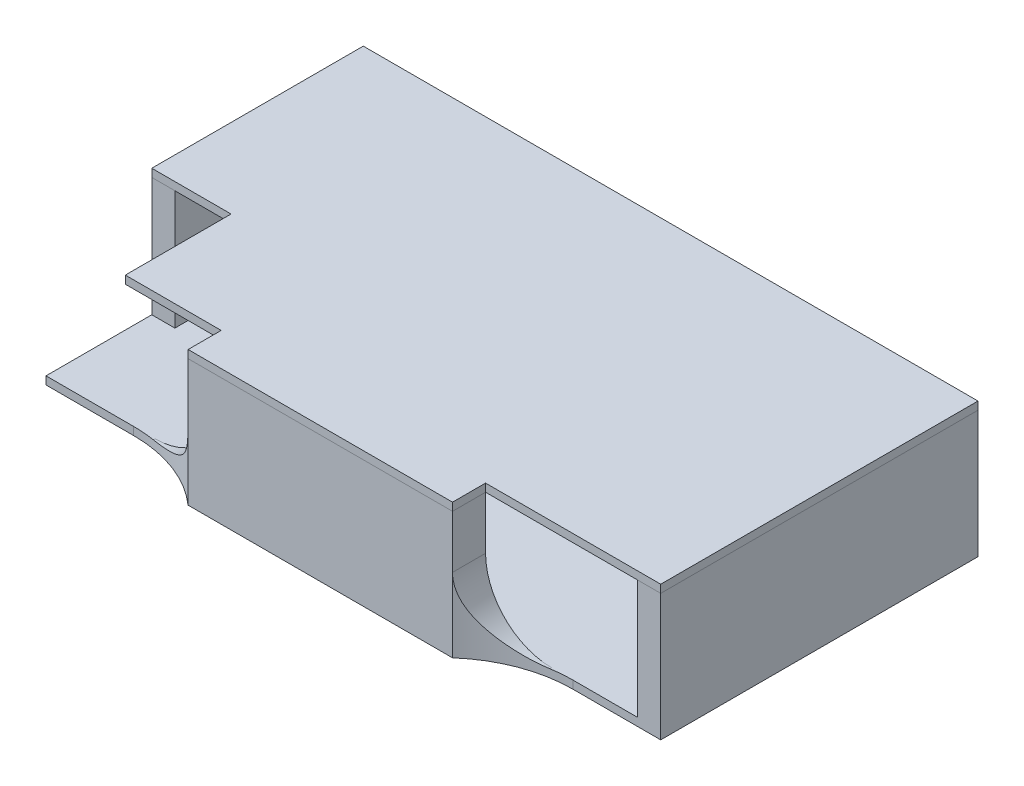
ISO-10303-21;
HEADER;
FILE_DESCRIPTION(('STEP AP214'),'2;1');
FILE_NAME('part.step','',(''),(''),'','','');
FILE_SCHEMA(('AUTOMOTIVE_DESIGN { 1 0 10303 214 1 1 1 1 }'));
ENDSEC;
DATA;
#1=APPLICATION_CONTEXT('core data for automotive mechanical design processes');
#2=APPLICATION_PROTOCOL_DEFINITION('international standard','automotive_design',2000,#1);
#3=PRODUCT_CONTEXT('',#1,'mechanical');
#4=PRODUCT('Part','Part','',(#3));
#5=PRODUCT_RELATED_PRODUCT_CATEGORY('part','',(#4));
#6=PRODUCT_DEFINITION_FORMATION('','',#4);
#7=PRODUCT_DEFINITION_CONTEXT('part definition',#1,'design');
#8=PRODUCT_DEFINITION('design','',#6,#7);
#9=PRODUCT_DEFINITION_SHAPE('','',#8);
#10=(LENGTH_UNIT() NAMED_UNIT(*) SI_UNIT(.MILLI.,.METRE.));
#11=(NAMED_UNIT(*) PLANE_ANGLE_UNIT() SI_UNIT($,.RADIAN.));
#12=(NAMED_UNIT(*) SI_UNIT($,.STERADIAN.) SOLID_ANGLE_UNIT());
#13=UNCERTAINTY_MEASURE_WITH_UNIT(LENGTH_MEASURE(1.E-05),#10,'distance_accuracy_value','');
#14=(GEOMETRIC_REPRESENTATION_CONTEXT(3) GLOBAL_UNCERTAINTY_ASSIGNED_CONTEXT((#13)) GLOBAL_UNIT_ASSIGNED_CONTEXT((#10,
#11,#12)) REPRESENTATION_CONTEXT('',''));
#15=CARTESIAN_POINT('',(0.,0.,0.));
#16=DIRECTION('',(0.,0.,1.));
#17=DIRECTION('',(1.,0.,0.));
#18=AXIS2_PLACEMENT_3D('',#15,#16,#17);
#19=CARTESIAN_POINT('',(-23.25,10.2,-12.));
#20=DIRECTION('',(1.,0.,0.));
#21=DIRECTION('',(0.,0.,-1.));
#22=AXIS2_PLACEMENT_3D('',#19,#20,#21);
#23=PLANE('',#22);
#24=DIRECTION('',(0.,0.,1.));
#25=VECTOR('',#24,1.);
#26=CARTESIAN_POINT('',(-23.25,9.6,-12.));
#27=LINE('',#26,#25);
#28=CARTESIAN_POINT('',(-23.25,9.6,-12.));
#29=VERTEX_POINT('',#28);
#30=CARTESIAN_POINT('',(-23.25,9.6,4.));
#31=VERTEX_POINT('',#30);
#32=EDGE_CURVE('E153',#29,#31,#27,.T.);
#33=ORIENTED_EDGE('',*,*,#32,.T.);
#34=DIRECTION('',(0.,-1.,0.));
#35=VECTOR('',#34,1.);
#36=CARTESIAN_POINT('',(-23.25,10.2,4.));
#37=LINE('',#36,#35);
#38=CARTESIAN_POINT('',(-23.25,10.2,4.));
#39=VERTEX_POINT('',#38);
#40=EDGE_CURVE('E12',#39,#31,#37,.T.);
#41=ORIENTED_EDGE('',*,*,#40,.F.);
#42=DIRECTION('',(0.,0.,1.));
#43=VECTOR('',#42,1.);
#44=CARTESIAN_POINT('',(-23.25,10.2,-12.));
#45=LINE('',#44,#43);
#46=CARTESIAN_POINT('',(-23.25,10.2,-12.));
#47=VERTEX_POINT('',#46);
#48=EDGE_CURVE('E171',#47,#39,#45,.T.);
#49=ORIENTED_EDGE('',*,*,#48,.F.);
#50=DIRECTION('',(0.,-1.,0.));
#51=VECTOR('',#50,1.);
#52=CARTESIAN_POINT('',(-23.25,10.2,-12.));
#53=LINE('',#52,#51);
#54=EDGE_CURVE('E149',#47,#29,#53,.T.);
#55=ORIENTED_EDGE('',*,*,#54,.T.);
#56=EDGE_LOOP('',(#33,#41,#49,#55));
#57=FACE_BOUND('',#56,.T.);
#58=ADVANCED_FACE('F45',(#57),#23,.F.);
#59=CARTESIAN_POINT('',(-23.25,10.2,4.));
#60=DIRECTION('',(0.,0.,-1.));
#61=DIRECTION('',(-1.,0.,0.));
#62=AXIS2_PLACEMENT_3D('',#59,#60,#61);
#63=PLANE('',#62);
#64=DIRECTION('',(1.,0.,0.));
#65=VECTOR('',#64,1.);
#66=CARTESIAN_POINT('',(-23.25,9.6,4.));
#67=LINE('',#66,#65);
#68=CARTESIAN_POINT('',(-17.25,9.6,4.));
#69=VERTEX_POINT('',#68);
#70=EDGE_CURVE('E156',#31,#69,#67,.T.);
#71=ORIENTED_EDGE('',*,*,#70,.T.);
#72=DIRECTION('',(0.,-1.,0.));
#73=VECTOR('',#72,1.);
#74=CARTESIAN_POINT('',(-17.25,10.2,4.));
#75=LINE('',#74,#73);
#76=CARTESIAN_POINT('',(-17.25,10.2,4.));
#77=VERTEX_POINT('',#76);
#78=EDGE_CURVE('E53',#77,#69,#75,.T.);
#79=ORIENTED_EDGE('',*,*,#78,.F.);
#80=DIRECTION('',(1.,0.,0.));
#81=VECTOR('',#80,1.);
#82=CARTESIAN_POINT('',(-23.25,10.2,4.));
#83=LINE('',#82,#81);
#84=EDGE_CURVE('E110',#39,#77,#83,.T.);
#85=ORIENTED_EDGE('',*,*,#84,.F.);
#86=ORIENTED_EDGE('',*,*,#40,.T.);
#87=EDGE_LOOP('',(#71,#79,#85,#86));
#88=FACE_BOUND('',#87,.T.);
#89=ADVANCED_FACE('F220',(#88),#63,.F.);
#90=CARTESIAN_POINT('',(-17.25,10.2,4.));
#91=DIRECTION('',(1.,0.,0.));
#92=DIRECTION('',(0.,0.,-1.));
#93=AXIS2_PLACEMENT_3D('',#90,#91,#92);
#94=PLANE('',#93);
#95=DIRECTION('',(0.,0.,1.));
#96=VECTOR('',#95,1.);
#97=CARTESIAN_POINT('',(-17.25,9.6,4.));
#98=LINE('',#97,#96);
#99=CARTESIAN_POINT('',(-17.25,9.6,12.));
#100=VERTEX_POINT('',#99);
#101=EDGE_CURVE('E158',#69,#100,#98,.T.);
#102=ORIENTED_EDGE('',*,*,#101,.T.);
#103=DIRECTION('',(0.,-1.,0.));
#104=VECTOR('',#103,1.);
#105=CARTESIAN_POINT('',(-17.25,10.2,12.));
#106=LINE('',#105,#104);
#107=CARTESIAN_POINT('',(-17.25,10.2,12.));
#108=VERTEX_POINT('',#107);
#109=EDGE_CURVE('E184',#108,#100,#106,.T.);
#110=ORIENTED_EDGE('',*,*,#109,.F.);
#111=DIRECTION('',(0.,0.,1.));
#112=VECTOR('',#111,1.);
#113=CARTESIAN_POINT('',(-17.25,10.2,4.));
#114=LINE('',#113,#112);
#115=EDGE_CURVE('E192',#77,#108,#114,.T.);
#116=ORIENTED_EDGE('',*,*,#115,.F.);
#117=ORIENTED_EDGE('',*,*,#78,.T.);
#118=EDGE_LOOP('',(#102,#110,#116,#117));
#119=FACE_BOUND('',#118,.T.);
#120=ADVANCED_FACE('F190',(#119),#94,.F.);
#121=CARTESIAN_POINT('',(-17.25,10.2,12.));
#122=DIRECTION('',(0.,0.,-1.));
#123=DIRECTION('',(-1.,0.,0.));
#124=AXIS2_PLACEMENT_3D('',#121,#122,#123);
#125=PLANE('',#124);
#126=DIRECTION('',(1.,0.,0.));
#127=VECTOR('',#126,1.);
#128=CARTESIAN_POINT('',(-17.25,9.6,12.));
#129=LINE('',#128,#127);
#130=CARTESIAN_POINT('',(-10.,9.6,12.));
#131=VERTEX_POINT('',#130);
#132=EDGE_CURVE('E160',#100,#131,#129,.T.);
#133=ORIENTED_EDGE('',*,*,#132,.T.);
#134=DIRECTION('',(0.,-1.,0.));
#135=VECTOR('',#134,1.);
#136=CARTESIAN_POINT('',(-10.,10.2,12.));
#137=LINE('',#136,#135);
#138=CARTESIAN_POINT('',(-10.,10.2,12.));
#139=VERTEX_POINT('',#138);
#140=EDGE_CURVE('E181',#139,#131,#137,.T.);
#141=ORIENTED_EDGE('',*,*,#140,.F.);
#142=DIRECTION('',(1.,0.,0.));
#143=VECTOR('',#142,1.);
#144=CARTESIAN_POINT('',(-17.25,10.2,12.));
#145=LINE('',#144,#143);
#146=EDGE_CURVE('E210',#108,#139,#145,.T.);
#147=ORIENTED_EDGE('',*,*,#146,.F.);
#148=ORIENTED_EDGE('',*,*,#109,.T.);
#149=EDGE_LOOP('',(#133,#141,#147,#148));
#150=FACE_BOUND('',#149,.T.);
#151=ADVANCED_FACE('F201',(#150),#125,.F.);
#152=CARTESIAN_POINT('',(-10.,10.2,12.));
#153=DIRECTION('',(1.,0.,0.));
#154=DIRECTION('',(0.,0.,-1.));
#155=AXIS2_PLACEMENT_3D('',#152,#153,#154);
#156=PLANE('',#155);
#157=DIRECTION('',(0.,0.,1.));
#158=VECTOR('',#157,1.);
#159=CARTESIAN_POINT('',(-10.,9.6,12.));
#160=LINE('',#159,#158);
#161=CARTESIAN_POINT('',(-10.,9.6,14.5));
#162=VERTEX_POINT('',#161);
#163=EDGE_CURVE('E162',#131,#162,#160,.T.);
#164=ORIENTED_EDGE('',*,*,#163,.T.);
#165=DIRECTION('',(0.,-1.,0.));
#166=VECTOR('',#165,1.);
#167=CARTESIAN_POINT('',(-10.,10.2,14.5));
#168=LINE('',#167,#166);
#169=CARTESIAN_POINT('',(-10.,10.2,14.5));
#170=VERTEX_POINT('',#169);
#171=EDGE_CURVE('E178',#170,#162,#168,.T.);
#172=ORIENTED_EDGE('',*,*,#171,.F.);
#173=DIRECTION('',(0.,0.,1.));
#174=VECTOR('',#173,1.);
#175=CARTESIAN_POINT('',(-10.,10.2,12.));
#176=LINE('',#175,#174);
#177=EDGE_CURVE('E207',#139,#170,#176,.T.);
#178=ORIENTED_EDGE('',*,*,#177,.F.);
#179=ORIENTED_EDGE('',*,*,#140,.T.);
#180=EDGE_LOOP('',(#164,#172,#178,#179));
#181=FACE_BOUND('',#180,.T.);
#182=ADVANCED_FACE('F205',(#181),#156,.F.);
#183=CARTESIAN_POINT('',(-10.,10.2,14.5));
#184=DIRECTION('',(0.,0.,-1.));
#185=DIRECTION('',(-1.,0.,0.));
#186=AXIS2_PLACEMENT_3D('',#183,#184,#185);
#187=PLANE('',#186);
#188=DIRECTION('',(1.,0.,0.));
#189=VECTOR('',#188,1.);
#190=CARTESIAN_POINT('',(-10.,9.6,14.5));
#191=LINE('',#190,#189);
#192=CARTESIAN_POINT('',(10.,9.6,14.5));
#193=VERTEX_POINT('',#192);
#194=EDGE_CURVE('E164',#162,#193,#191,.T.);
#195=ORIENTED_EDGE('',*,*,#194,.T.);
#196=DIRECTION('',(0.,-1.,0.));
#197=VECTOR('',#196,1.);
#198=CARTESIAN_POINT('',(10.,10.2,14.5));
#199=LINE('',#198,#197);
#200=CARTESIAN_POINT('',(10.,10.2,14.5));
#201=VERTEX_POINT('',#200);
#202=EDGE_CURVE('E175',#201,#193,#199,.T.);
#203=ORIENTED_EDGE('',*,*,#202,.F.);
#204=DIRECTION('',(1.,0.,0.));
#205=VECTOR('',#204,1.);
#206=CARTESIAN_POINT('',(-10.,10.2,14.5));
#207=LINE('',#206,#205);
#208=EDGE_CURVE('E209',#170,#201,#207,.T.);
#209=ORIENTED_EDGE('',*,*,#208,.F.);
#210=ORIENTED_EDGE('',*,*,#171,.T.);
#211=EDGE_LOOP('',(#195,#203,#209,#210));
#212=FACE_BOUND('',#211,.T.);
#213=ADVANCED_FACE('F232',(#212),#187,.F.);
#214=CARTESIAN_POINT('',(10.,10.2,14.5));
#215=DIRECTION('',(-1.,0.,0.));
#216=DIRECTION('',(0.,0.,1.));
#217=AXIS2_PLACEMENT_3D('',#214,#215,#216);
#218=PLANE('',#217);
#219=DIRECTION('',(0.,0.,-1.));
#220=VECTOR('',#219,1.);
#221=CARTESIAN_POINT('',(10.,9.6,14.5));
#222=LINE('',#221,#220);
#223=CARTESIAN_POINT('',(10.,9.6,12.));
#224=VERTEX_POINT('',#223);
#225=EDGE_CURVE('E166',#193,#224,#222,.T.);
#226=ORIENTED_EDGE('',*,*,#225,.T.);
#227=DIRECTION('',(0.,-1.,0.));
#228=VECTOR('',#227,1.);
#229=CARTESIAN_POINT('',(10.,10.2,12.));
#230=LINE('',#229,#228);
#231=CARTESIAN_POINT('',(10.,10.2,12.));
#232=VERTEX_POINT('',#231);
#233=EDGE_CURVE('E144',#232,#224,#230,.T.);
#234=ORIENTED_EDGE('',*,*,#233,.F.);
#235=DIRECTION('',(0.,0.,-1.));
#236=VECTOR('',#235,1.);
#237=CARTESIAN_POINT('',(10.,10.2,14.5));
#238=LINE('',#237,#236);
#239=EDGE_CURVE('E135',#201,#232,#238,.T.);
#240=ORIENTED_EDGE('',*,*,#239,.F.);
#241=ORIENTED_EDGE('',*,*,#202,.T.);
#242=EDGE_LOOP('',(#226,#234,#240,#241));
#243=FACE_BOUND('',#242,.T.);
#244=ADVANCED_FACE('F235',(#243),#218,.F.);
#245=CARTESIAN_POINT('',(10.,10.2,12.));
#246=DIRECTION('',(0.,0.,-1.));
#247=DIRECTION('',(-1.,0.,0.));
#248=AXIS2_PLACEMENT_3D('',#245,#246,#247);
#249=PLANE('',#248);
#250=DIRECTION('',(1.,0.,0.));
#251=VECTOR('',#250,1.);
#252=CARTESIAN_POINT('',(10.,9.6,12.));
#253=LINE('',#252,#251);
#254=CARTESIAN_POINT('',(23.25,9.6,12.));
#255=VERTEX_POINT('',#254);
#256=EDGE_CURVE('E143',#224,#255,#253,.T.);
#257=ORIENTED_EDGE('',*,*,#256,.T.);
#258=DIRECTION('',(0.,-1.,0.));
#259=VECTOR('',#258,1.);
#260=CARTESIAN_POINT('',(23.25,10.2,12.));
#261=LINE('',#260,#259);
#262=CARTESIAN_POINT('',(23.25,10.2,12.));
#263=VERTEX_POINT('',#262);
#264=EDGE_CURVE('E140',#263,#255,#261,.T.);
#265=ORIENTED_EDGE('',*,*,#264,.F.);
#266=DIRECTION('',(1.,0.,0.));
#267=VECTOR('',#266,1.);
#268=CARTESIAN_POINT('',(10.,10.2,12.));
#269=LINE('',#268,#267);
#270=EDGE_CURVE('E129',#232,#263,#269,.T.);
#271=ORIENTED_EDGE('',*,*,#270,.F.);
#272=ORIENTED_EDGE('',*,*,#233,.T.);
#273=EDGE_LOOP('',(#257,#265,#271,#272));
#274=FACE_BOUND('',#273,.T.);
#275=ADVANCED_FACE('F141',(#274),#249,.F.);
#276=CARTESIAN_POINT('',(23.25,10.2,-12.));
#277=DIRECTION('',(-1.,0.,0.));
#278=DIRECTION('',(0.,0.,1.));
#279=AXIS2_PLACEMENT_3D('',#276,#277,#278);
#280=PLANE('',#279);
#281=DIRECTION('',(0.,0.,-1.));
#282=VECTOR('',#281,1.);
#283=CARTESIAN_POINT('',(23.25,9.6,-12.));
#284=LINE('',#283,#282);
#285=CARTESIAN_POINT('',(23.25,9.6,-12.));
#286=VERTEX_POINT('',#285);
#287=EDGE_CURVE('E96',#255,#286,#284,.T.);
#288=ORIENTED_EDGE('',*,*,#287,.T.);
#289=DIRECTION('',(0.,-1.,0.));
#290=VECTOR('',#289,1.);
#291=CARTESIAN_POINT('',(23.25,10.2,-12.));
#292=LINE('',#291,#290);
#293=CARTESIAN_POINT('',(23.25,10.2,-12.));
#294=VERTEX_POINT('',#293);
#295=EDGE_CURVE('E145',#294,#286,#292,.T.);
#296=ORIENTED_EDGE('',*,*,#295,.F.);
#297=DIRECTION('',(0.,0.,-1.));
#298=VECTOR('',#297,1.);
#299=CARTESIAN_POINT('',(23.25,10.2,-12.));
#300=LINE('',#299,#298);
#301=EDGE_CURVE('E133',#263,#294,#300,.T.);
#302=ORIENTED_EDGE('',*,*,#301,.F.);
#303=ORIENTED_EDGE('',*,*,#264,.T.);
#304=EDGE_LOOP('',(#288,#296,#302,#303));
#305=FACE_BOUND('',#304,.T.);
#306=ADVANCED_FACE('F147',(#305),#280,.F.);
#307=CARTESIAN_POINT('',(-23.25,10.2,-12.));
#308=DIRECTION('',(0.,0.,1.));
#309=DIRECTION('',(1.,0.,0.));
#310=AXIS2_PLACEMENT_3D('',#307,#308,#309);
#311=PLANE('',#310);
#312=DIRECTION('',(-1.,0.,0.));
#313=VECTOR('',#312,1.);
#314=CARTESIAN_POINT('',(-23.25,9.6,-12.));
#315=LINE('',#314,#313);
#316=EDGE_CURVE('E102',#286,#29,#315,.T.);
#317=ORIENTED_EDGE('',*,*,#316,.T.);
#318=ORIENTED_EDGE('',*,*,#54,.F.);
#319=DIRECTION('',(-1.,0.,0.));
#320=VECTOR('',#319,1.);
#321=CARTESIAN_POINT('',(-23.25,10.2,-12.));
#322=LINE('',#321,#320);
#323=EDGE_CURVE('E61',#294,#47,#322,.T.);
#324=ORIENTED_EDGE('',*,*,#323,.F.);
#325=ORIENTED_EDGE('',*,*,#295,.T.);
#326=EDGE_LOOP('',(#317,#318,#324,#325));
#327=FACE_BOUND('',#326,.T.);
#328=ADVANCED_FACE('F244',(#327),#311,.F.);
#329=CARTESIAN_POINT('',(0.,10.2,0.));
#330=DIRECTION('',(0.,1.,0.));
#331=DIRECTION('',(0.,0.,1.));
#332=AXIS2_PLACEMENT_3D('',#329,#330,#331);
#333=PLANE('',#332);
#334=ORIENTED_EDGE('',*,*,#48,.T.);
#335=ORIENTED_EDGE('',*,*,#84,.T.);
#336=ORIENTED_EDGE('',*,*,#115,.T.);
#337=ORIENTED_EDGE('',*,*,#146,.T.);
#338=ORIENTED_EDGE('',*,*,#177,.T.);
#339=ORIENTED_EDGE('',*,*,#208,.T.);
#340=ORIENTED_EDGE('',*,*,#239,.T.);
#341=ORIENTED_EDGE('',*,*,#270,.T.);
#342=ORIENTED_EDGE('',*,*,#301,.T.);
#343=ORIENTED_EDGE('',*,*,#323,.T.);
#344=EDGE_LOOP('',(#334,#335,#336,#337,#338,#339,#340,#341,#342,#343));
#345=FACE_BOUND('',#344,.T.);
#346=ADVANCED_FACE('F131',(#345),#333,.T.);
#347=CARTESIAN_POINT('',(0.,9.6,0.));
#348=DIRECTION('',(0.,1.,0.));
#349=DIRECTION('',(0.,0.,1.));
#350=AXIS2_PLACEMENT_3D('',#347,#348,#349);
#351=PLANE('',#350);
#352=ORIENTED_EDGE('',*,*,#32,.F.);
#353=ORIENTED_EDGE('',*,*,#316,.F.);
#354=ORIENTED_EDGE('',*,*,#287,.F.);
#355=ORIENTED_EDGE('',*,*,#256,.F.);
#356=ORIENTED_EDGE('',*,*,#225,.F.);
#357=ORIENTED_EDGE('',*,*,#194,.F.);
#358=ORIENTED_EDGE('',*,*,#163,.F.);
#359=ORIENTED_EDGE('',*,*,#132,.F.);
#360=ORIENTED_EDGE('',*,*,#101,.F.);
#361=ORIENTED_EDGE('',*,*,#70,.F.);
#362=EDGE_LOOP('',(#352,#353,#354,#355,#356,#357,#358,#359,#360,#361));
#363=FACE_BOUND('',#362,.T.);
#364=ADVANCED_FACE('F196',(#363),#351,.F.);
#365=CLOSED_SHELL('',(#58,#89,#120,#151,#182,#213,#244,#275,#306,#328,#346,#364));
#366=MANIFOLD_SOLID_BREP('B2',#365);
#367=CARTESIAN_POINT('',(23.25,0.6,12.));
#368=DIRECTION('',(0.,0.,-1.));
#369=DIRECTION('',(-1.,0.,0.));
#370=AXIS2_PLACEMENT_3D('',#367,#368,#369);
#371=PLANE('',#370);
#372=DIRECTION('',(1.,0.,0.));
#373=VECTOR('',#372,1.);
#374=CARTESIAN_POINT('',(23.25,0.,12.));
#375=LINE('',#374,#373);
#376=CARTESIAN_POINT('',(-23.25,0.,12.));
#377=VERTEX_POINT('',#376);
#378=CARTESIAN_POINT('',(-16.6143782776615,0.,12.));
#379=VERTEX_POINT('',#378);
#380=EDGE_CURVE('E482',#377,#379,#375,.T.);
#381=ORIENTED_EDGE('',*,*,#380,.T.);
#382=DIRECTION('',(0.,1.,0.));
#383=VECTOR('',#382,1.);
#384=CARTESIAN_POINT('',(-16.6143782776615,0.6,12.));
#385=LINE('',#384,#383);
#386=CARTESIAN_POINT('',(-16.6143782776615,0.6,12.));
#387=VERTEX_POINT('',#386);
#388=EDGE_CURVE('E505',#379,#387,#385,.T.);
#389=ORIENTED_EDGE('',*,*,#388,.T.);
#390=DIRECTION('',(1.,0.,0.));
#391=VECTOR('',#390,1.);
#392=CARTESIAN_POINT('',(23.25,0.6,12.));
#393=LINE('',#392,#391);
#394=CARTESIAN_POINT('',(-23.25,0.6,12.));
#395=VERTEX_POINT('',#394);
#396=EDGE_CURVE('E395',#395,#387,#393,.T.);
#397=ORIENTED_EDGE('',*,*,#396,.F.);
#398=DIRECTION('',(0.,-1.,0.));
#399=VECTOR('',#398,1.);
#400=CARTESIAN_POINT('',(-23.25,0.6,12.));
#401=LINE('',#400,#399);
#402=EDGE_CURVE('E467',#395,#377,#401,.T.);
#403=ORIENTED_EDGE('',*,*,#402,.T.);
#404=EDGE_LOOP('',(#381,#389,#397,#403));
#405=FACE_BOUND('',#404,.T.);
#406=ADVANCED_FACE('F325',(#405),#371,.F.);
#407=CARTESIAN_POINT('',(16.6143782776615,0.6,12.));
#408=VERTEX_POINT('',#407);
#409=CARTESIAN_POINT('',(21.5,0.6,12.));
#410=VERTEX_POINT('',#409);
#411=EDGE_CURVE('E396',#408,#410,#393,.T.);
#412=ORIENTED_EDGE('',*,*,#411,.F.);
#413=DIRECTION('',(0.,-1.,0.));
#414=VECTOR('',#413,1.);
#415=CARTESIAN_POINT('',(16.6143782776615,0.6,12.));
#416=LINE('',#415,#414);
#417=CARTESIAN_POINT('',(16.6143782776615,0.,12.));
#418=VERTEX_POINT('',#417);
#419=EDGE_CURVE('E508',#408,#418,#416,.T.);
#420=ORIENTED_EDGE('',*,*,#419,.T.);
#421=CARTESIAN_POINT('',(23.25,0.,12.));
#422=VERTEX_POINT('',#421);
#423=EDGE_CURVE('E478',#418,#422,#375,.T.);
#424=ORIENTED_EDGE('',*,*,#423,.T.);
#425=DIRECTION('',(0.,-1.,0.));
#426=VECTOR('',#425,1.);
#427=CARTESIAN_POINT('',(23.25,0.6,12.));
#428=LINE('',#427,#426);
#429=CARTESIAN_POINT('',(23.25,9.6,12.));
#430=VERTEX_POINT('',#429);
#431=EDGE_CURVE('E501',#430,#422,#428,.T.);
#432=ORIENTED_EDGE('',*,*,#431,.F.);
#433=DIRECTION('',(1.,0.,0.));
#434=VECTOR('',#433,1.);
#435=CARTESIAN_POINT('',(23.25,9.6,12.));
#436=LINE('',#435,#434);
#437=CARTESIAN_POINT('',(21.5,9.6,12.));
#438=VERTEX_POINT('',#437);
#439=EDGE_CURVE('E587',#438,#430,#436,.T.);
#440=ORIENTED_EDGE('',*,*,#439,.F.);
#441=DIRECTION('',(0.,-1.,0.));
#442=VECTOR('',#441,1.);
#443=CARTESIAN_POINT('',(21.5,9.6,12.));
#444=LINE('',#443,#442);
#445=EDGE_CURVE('E485',#438,#410,#444,.T.);
#446=ORIENTED_EDGE('',*,*,#445,.T.);
#447=EDGE_LOOP('',(#412,#420,#424,#432,#440,#446));
#448=FACE_BOUND('',#447,.T.);
#449=ADVANCED_FACE('F437',(#448),#371,.F.);
#450=CARTESIAN_POINT('',(0.,0.6,0.));
#451=DIRECTION('',(0.,1.,0.));
#452=DIRECTION('',(0.,0.,1.));
#453=AXIS2_PLACEMENT_3D('',#450,#451,#452);
#454=PLANE('',#453);
#455=CARTESIAN_POINT('',(-16.6143782776615,0.6,22.));
#456=DIRECTION('',(0.,1.,0.));
#457=DIRECTION('',(0.,0.,1.));
#458=AXIS2_PLACEMENT_3D('',#455,#456,#457);
#459=CIRCLE('',#458,10.);
#460=CARTESIAN_POINT('',(-15.,0.6,12.1311711547613));
#461=VERTEX_POINT('',#460);
#462=EDGE_CURVE('E514',#387,#461,#459,.F.);
#463=ORIENTED_EDGE('',*,*,#462,.T.);
#464=DIRECTION('',(0.,0.,1.));
#465=VECTOR('',#464,1.);
#466=CARTESIAN_POINT('',(-15.,0.6,0.));
#467=LINE('',#466,#465);
#468=CARTESIAN_POINT('',(-15.,0.6,12.));
#469=VERTEX_POINT('',#468);
#470=EDGE_CURVE('E394',#461,#469,#467,.F.);
#471=ORIENTED_EDGE('',*,*,#470,.T.);
#472=CARTESIAN_POINT('',(15.,0.6,12.));
#473=VERTEX_POINT('',#472);
#474=EDGE_CURVE('E388',#469,#473,#393,.T.);
#475=ORIENTED_EDGE('',*,*,#474,.T.);
#476=DIRECTION('',(0.,0.,-1.));
#477=VECTOR('',#476,1.);
#478=CARTESIAN_POINT('',(15.,0.6,0.));
#479=LINE('',#478,#477);
#480=CARTESIAN_POINT('',(15.,0.6,12.1311711547613));
#481=VERTEX_POINT('',#480);
#482=EDGE_CURVE('E391',#473,#481,#479,.F.);
#483=ORIENTED_EDGE('',*,*,#482,.T.);
#484=CARTESIAN_POINT('',(16.6143782776615,0.6,22.));
#485=DIRECTION('',(0.,1.,0.));
#486=DIRECTION('',(0.,0.,1.));
#487=AXIS2_PLACEMENT_3D('',#484,#485,#486);
#488=CIRCLE('',#487,10.);
#489=EDGE_CURVE('E516',#481,#408,#488,.F.);
#490=ORIENTED_EDGE('',*,*,#489,.T.);
#491=ORIENTED_EDGE('',*,*,#411,.T.);
#492=DIRECTION('',(0.,0.,1.));
#493=VECTOR('',#492,1.);
#494=CARTESIAN_POINT('',(21.5,0.6,-12.));
#495=LINE('',#494,#493);
#496=CARTESIAN_POINT('',(21.5,0.6,-12.));
#497=VERTEX_POINT('',#496);
#498=EDGE_CURVE('E577',#497,#410,#495,.T.);
#499=ORIENTED_EDGE('',*,*,#498,.F.);
#500=DIRECTION('',(-1.,0.,0.));
#501=VECTOR('',#500,1.);
#502=CARTESIAN_POINT('',(23.25,0.6,-12.));
#503=LINE('',#502,#501);
#504=CARTESIAN_POINT('',(-21.5,0.6,-12.));
#505=VERTEX_POINT('',#504);
#506=EDGE_CURVE('E488',#497,#505,#503,.T.);
#507=ORIENTED_EDGE('',*,*,#506,.T.);
#508=DIRECTION('',(0.,0.,-1.));
#509=VECTOR('',#508,1.);
#510=CARTESIAN_POINT('',(-21.5,0.6,-12.));
#511=LINE('',#510,#509);
#512=CARTESIAN_POINT('',(-21.5,0.6,4.));
#513=VERTEX_POINT('',#512);
#514=EDGE_CURVE('E555',#513,#505,#511,.T.);
#515=ORIENTED_EDGE('',*,*,#514,.F.);
#516=DIRECTION('',(1.,0.,0.));
#517=VECTOR('',#516,1.);
#518=CARTESIAN_POINT('',(-23.25,0.6,4.));
#519=LINE('',#518,#517);
#520=CARTESIAN_POINT('',(-23.25,0.6,4.));
#521=VERTEX_POINT('',#520);
#522=EDGE_CURVE('E550',#521,#513,#519,.T.);
#523=ORIENTED_EDGE('',*,*,#522,.F.);
#524=DIRECTION('',(0.,0.,1.));
#525=VECTOR('',#524,1.);
#526=CARTESIAN_POINT('',(-23.25,0.6,12.));
#527=LINE('',#526,#525);
#528=EDGE_CURVE('E496',#521,#395,#527,.T.);
#529=ORIENTED_EDGE('',*,*,#528,.T.);
#530=ORIENTED_EDGE('',*,*,#396,.T.);
#531=EDGE_LOOP('',(#463,#471,#475,#483,#490,#491,#499,#507,#515,#523,#529,#530));
#532=FACE_BOUND('',#531,.T.);
#533=ADVANCED_FACE('F390',(#532),#454,.T.);
#534=CARTESIAN_POINT('',(-23.25,0.6,12.));
#535=DIRECTION('',(1.,0.,0.));
#536=DIRECTION('',(0.,0.,-1.));
#537=AXIS2_PLACEMENT_3D('',#534,#535,#536);
#538=PLANE('',#537);
#539=DIRECTION('',(0.,0.,1.));
#540=VECTOR('',#539,1.);
#541=CARTESIAN_POINT('',(-23.25,0.,12.));
#542=LINE('',#541,#540);
#543=CARTESIAN_POINT('',(-23.25,0.,-12.));
#544=VERTEX_POINT('',#543);
#545=EDGE_CURVE('E463',#544,#377,#542,.T.);
#546=ORIENTED_EDGE('',*,*,#545,.T.);
#547=ORIENTED_EDGE('',*,*,#402,.F.);
#548=ORIENTED_EDGE('',*,*,#528,.F.);
#549=DIRECTION('',(0.,-1.,0.));
#550=VECTOR('',#549,1.);
#551=CARTESIAN_POINT('',(-23.25,9.6,4.));
#552=LINE('',#551,#550);
#553=CARTESIAN_POINT('',(-23.25,9.6,4.));
#554=VERTEX_POINT('',#553);
#555=EDGE_CURVE('E574',#554,#521,#552,.T.);
#556=ORIENTED_EDGE('',*,*,#555,.F.);
#557=DIRECTION('',(0.,0.,1.));
#558=VECTOR('',#557,1.);
#559=CARTESIAN_POINT('',(-23.25,9.6,-12.));
#560=LINE('',#559,#558);
#561=CARTESIAN_POINT('',(-23.25,9.6,-12.));
#562=VERTEX_POINT('',#561);
#563=EDGE_CURVE('E551',#562,#554,#560,.T.);
#564=ORIENTED_EDGE('',*,*,#563,.F.);
#565=DIRECTION('',(0.,-1.,0.));
#566=VECTOR('',#565,1.);
#567=CARTESIAN_POINT('',(-23.25,0.6,-12.));
#568=LINE('',#567,#566);
#569=EDGE_CURVE('E471',#562,#544,#568,.T.);
#570=ORIENTED_EDGE('',*,*,#569,.T.);
#571=EDGE_LOOP('',(#546,#547,#548,#556,#564,#570));
#572=FACE_BOUND('',#571,.T.);
#573=ADVANCED_FACE('F448',(#572),#538,.F.);
#574=CARTESIAN_POINT('',(23.25,0.6,12.));
#575=DIRECTION('',(-1.,0.,0.));
#576=DIRECTION('',(0.,0.,1.));
#577=AXIS2_PLACEMENT_3D('',#574,#575,#576);
#578=PLANE('',#577);
#579=DIRECTION('',(0.,0.,-1.));
#580=VECTOR('',#579,1.);
#581=CARTESIAN_POINT('',(23.25,0.,12.));
#582=LINE('',#581,#580);
#583=CARTESIAN_POINT('',(23.25,0.,-12.));
#584=VERTEX_POINT('',#583);
#585=EDGE_CURVE('E490',#422,#584,#582,.T.);
#586=ORIENTED_EDGE('',*,*,#585,.T.);
#587=DIRECTION('',(0.,-1.,0.));
#588=VECTOR('',#587,1.);
#589=CARTESIAN_POINT('',(23.25,0.6,-12.));
#590=LINE('',#589,#588);
#591=CARTESIAN_POINT('',(23.25,9.6,-12.));
#592=VERTEX_POINT('',#591);
#593=EDGE_CURVE('E498',#592,#584,#590,.T.);
#594=ORIENTED_EDGE('',*,*,#593,.F.);
#595=DIRECTION('',(0.,0.,-1.));
#596=VECTOR('',#595,1.);
#597=CARTESIAN_POINT('',(23.25,9.6,-12.));
#598=LINE('',#597,#596);
#599=EDGE_CURVE('E578',#430,#592,#598,.T.);
#600=ORIENTED_EDGE('',*,*,#599,.F.);
#601=ORIENTED_EDGE('',*,*,#431,.T.);
#602=EDGE_LOOP('',(#586,#594,#600,#601));
#603=FACE_BOUND('',#602,.T.);
#604=ADVANCED_FACE('F446',(#603),#578,.F.);
#605=CARTESIAN_POINT('',(23.25,0.6,-12.));
#606=DIRECTION('',(0.,0.,1.));
#607=DIRECTION('',(1.,0.,0.));
#608=AXIS2_PLACEMENT_3D('',#605,#606,#607);
#609=PLANE('',#608);
#610=DIRECTION('',(-1.,0.,0.));
#611=VECTOR('',#610,1.);
#612=CARTESIAN_POINT('',(23.25,0.,-12.));
#613=LINE('',#612,#611);
#614=EDGE_CURVE('E493',#584,#544,#613,.T.);
#615=ORIENTED_EDGE('',*,*,#614,.T.);
#616=ORIENTED_EDGE('',*,*,#569,.F.);
#617=DIRECTION('',(-1.,0.,0.));
#618=VECTOR('',#617,1.);
#619=CARTESIAN_POINT('',(-23.25,9.6,-12.));
#620=LINE('',#619,#618);
#621=CARTESIAN_POINT('',(-21.5,9.6,-12.));
#622=VERTEX_POINT('',#621);
#623=EDGE_CURVE('E561',#622,#562,#620,.T.);
#624=ORIENTED_EDGE('',*,*,#623,.F.);
#625=DIRECTION('',(0.,-1.,0.));
#626=VECTOR('',#625,1.);
#627=CARTESIAN_POINT('',(-21.5,9.6,-12.));
#628=LINE('',#627,#626);
#629=EDGE_CURVE('E564',#622,#505,#628,.T.);
#630=ORIENTED_EDGE('',*,*,#629,.T.);
#631=ORIENTED_EDGE('',*,*,#506,.F.);
#632=DIRECTION('',(0.,-1.,0.));
#633=VECTOR('',#632,1.);
#634=CARTESIAN_POINT('',(21.5,9.6,-12.));
#635=LINE('',#634,#633);
#636=CARTESIAN_POINT('',(21.5,9.6,-12.));
#637=VERTEX_POINT('',#636);
#638=EDGE_CURVE('E479',#637,#497,#635,.T.);
#639=ORIENTED_EDGE('',*,*,#638,.F.);
#640=DIRECTION('',(-1.,0.,0.));
#641=VECTOR('',#640,1.);
#642=CARTESIAN_POINT('',(23.25,9.6,-12.));
#643=LINE('',#642,#641);
#644=EDGE_CURVE('E581',#592,#637,#643,.T.);
#645=ORIENTED_EDGE('',*,*,#644,.F.);
#646=ORIENTED_EDGE('',*,*,#593,.T.);
#647=EDGE_LOOP('',(#615,#616,#624,#630,#631,#639,#645,#646));
#648=FACE_BOUND('',#647,.T.);
#649=ADVANCED_FACE('F455',(#648),#609,.F.);
#650=CARTESIAN_POINT('',(0.,0.,0.));
#651=DIRECTION('',(0.,1.,0.));
#652=DIRECTION('',(0.,0.,1.));
#653=AXIS2_PLACEMENT_3D('',#650,#651,#652);
#654=PLANE('',#653);
#655=ORIENTED_EDGE('',*,*,#545,.F.);
#656=ORIENTED_EDGE('',*,*,#614,.F.);
#657=ORIENTED_EDGE('',*,*,#585,.F.);
#658=ORIENTED_EDGE('',*,*,#423,.F.);
#659=CARTESIAN_POINT('',(16.6143782776615,0.,22.));
#660=DIRECTION('',(0.,1.,0.));
#661=DIRECTION('',(0.,0.,1.));
#662=AXIS2_PLACEMENT_3D('',#659,#660,#661);
#663=CIRCLE('',#662,10.);
#664=CARTESIAN_POINT('',(10.,0.,14.5));
#665=VERTEX_POINT('',#664);
#666=EDGE_CURVE('E409',#418,#665,#663,.T.);
#667=ORIENTED_EDGE('',*,*,#666,.T.);
#668=DIRECTION('',(1.,0.,0.));
#669=VECTOR('',#668,1.);
#670=CARTESIAN_POINT('',(-10.,0.,14.5));
#671=LINE('',#670,#669);
#672=CARTESIAN_POINT('',(-10.,0.,14.5));
#673=VERTEX_POINT('',#672);
#674=EDGE_CURVE('E523',#673,#665,#671,.T.);
#675=ORIENTED_EDGE('',*,*,#674,.F.);
#676=CARTESIAN_POINT('',(-16.6143782776615,0.,22.));
#677=DIRECTION('',(0.,1.,0.));
#678=DIRECTION('',(0.,0.,1.));
#679=AXIS2_PLACEMENT_3D('',#676,#677,#678);
#680=CIRCLE('',#679,10.);
#681=EDGE_CURVE('E511',#673,#379,#680,.T.);
#682=ORIENTED_EDGE('',*,*,#681,.T.);
#683=ORIENTED_EDGE('',*,*,#380,.F.);
#684=EDGE_LOOP('',(#655,#656,#657,#658,#667,#675,#682,#683));
#685=FACE_BOUND('',#684,.T.);
#686=ADVANCED_FACE('F521',(#685),#654,.F.);
#687=CARTESIAN_POINT('',(21.5,9.6,-12.));
#688=DIRECTION('',(1.,0.,0.));
#689=DIRECTION('',(0.,0.,-1.));
#690=AXIS2_PLACEMENT_3D('',#687,#688,#689);
#691=PLANE('',#690);
#692=ORIENTED_EDGE('',*,*,#498,.T.);
#693=ORIENTED_EDGE('',*,*,#445,.F.);
#694=DIRECTION('',(0.,0.,1.));
#695=VECTOR('',#694,1.);
#696=CARTESIAN_POINT('',(21.5,9.6,-12.));
#697=LINE('',#696,#695);
#698=EDGE_CURVE('E584',#637,#438,#697,.T.);
#699=ORIENTED_EDGE('',*,*,#698,.F.);
#700=ORIENTED_EDGE('',*,*,#638,.T.);
#701=EDGE_LOOP('',(#692,#693,#699,#700));
#702=FACE_BOUND('',#701,.T.);
#703=ADVANCED_FACE('F611',(#702),#691,.F.);
#704=CARTESIAN_POINT('',(0.,9.6,0.));
#705=DIRECTION('',(0.,-1.,0.));
#706=DIRECTION('',(0.,0.,-1.));
#707=AXIS2_PLACEMENT_3D('',#704,#705,#706);
#708=PLANE('',#707);
#709=ORIENTED_EDGE('',*,*,#599,.T.);
#710=ORIENTED_EDGE('',*,*,#644,.T.);
#711=ORIENTED_EDGE('',*,*,#698,.T.);
#712=ORIENTED_EDGE('',*,*,#439,.T.);
#713=EDGE_LOOP('',(#709,#710,#711,#712));
#714=FACE_BOUND('',#713,.T.);
#715=ADVANCED_FACE('F621',(#714),#708,.F.);
#716=CARTESIAN_POINT('',(-23.25,9.6,4.));
#717=DIRECTION('',(0.,0.,-1.));
#718=DIRECTION('',(-1.,0.,0.));
#719=AXIS2_PLACEMENT_3D('',#716,#717,#718);
#720=PLANE('',#719);
#721=ORIENTED_EDGE('',*,*,#522,.T.);
#722=DIRECTION('',(0.,-1.,0.));
#723=VECTOR('',#722,1.);
#724=CARTESIAN_POINT('',(-21.5,9.6,4.));
#725=LINE('',#724,#723);
#726=CARTESIAN_POINT('',(-21.5,9.6,4.));
#727=VERTEX_POINT('',#726);
#728=EDGE_CURVE('E571',#727,#513,#725,.T.);
#729=ORIENTED_EDGE('',*,*,#728,.F.);
#730=DIRECTION('',(1.,0.,0.));
#731=VECTOR('',#730,1.);
#732=CARTESIAN_POINT('',(-23.25,9.6,4.));
#733=LINE('',#732,#731);
#734=EDGE_CURVE('E554',#554,#727,#733,.T.);
#735=ORIENTED_EDGE('',*,*,#734,.F.);
#736=ORIENTED_EDGE('',*,*,#555,.T.);
#737=EDGE_LOOP('',(#721,#729,#735,#736));
#738=FACE_BOUND('',#737,.T.);
#739=ADVANCED_FACE('F678',(#738),#720,.F.);
#740=CARTESIAN_POINT('',(-21.5,9.6,-12.));
#741=DIRECTION('',(-1.,0.,0.));
#742=DIRECTION('',(0.,0.,1.));
#743=AXIS2_PLACEMENT_3D('',#740,#741,#742);
#744=PLANE('',#743);
#745=ORIENTED_EDGE('',*,*,#514,.T.);
#746=ORIENTED_EDGE('',*,*,#629,.F.);
#747=DIRECTION('',(0.,0.,-1.));
#748=VECTOR('',#747,1.);
#749=CARTESIAN_POINT('',(-21.5,9.6,-12.));
#750=LINE('',#749,#748);
#751=EDGE_CURVE('E558',#727,#622,#750,.T.);
#752=ORIENTED_EDGE('',*,*,#751,.F.);
#753=ORIENTED_EDGE('',*,*,#728,.T.);
#754=EDGE_LOOP('',(#745,#746,#752,#753));
#755=FACE_BOUND('',#754,.T.);
#756=ADVANCED_FACE('F681',(#755),#744,.F.);
#757=CARTESIAN_POINT('',(0.,9.6,0.));
#758=DIRECTION('',(0.,1.,0.));
#759=DIRECTION('',(0.,0.,1.));
#760=AXIS2_PLACEMENT_3D('',#757,#758,#759);
#761=PLANE('',#760);
#762=ORIENTED_EDGE('',*,*,#563,.T.);
#763=ORIENTED_EDGE('',*,*,#734,.T.);
#764=ORIENTED_EDGE('',*,*,#751,.T.);
#765=ORIENTED_EDGE('',*,*,#623,.T.);
#766=EDGE_LOOP('',(#762,#763,#764,#765));
#767=FACE_BOUND('',#766,.T.);
#768=ADVANCED_FACE('F673',(#767),#761,.T.);
#769=CARTESIAN_POINT('',(0.,0.,12.));
#770=DIRECTION('',(0.,0.,-1.));
#771=DIRECTION('',(-1.,0.,0.));
#772=AXIS2_PLACEMENT_3D('',#769,#770,#771);
#773=PLANE('',#772);
#774=ORIENTED_EDGE('',*,*,#474,.F.);
#775=CARTESIAN_POINT('',(-15.,5.6,12.));
#776=DIRECTION('',(0.,0.,-1.));
#777=DIRECTION('',(-1.,0.,0.));
#778=AXIS2_PLACEMENT_3D('',#775,#776,#777);
#779=CIRCLE('',#778,5.);
#780=CARTESIAN_POINT('',(-10.,5.6,12.));
#781=VERTEX_POINT('',#780);
#782=EDGE_CURVE('E377',#469,#781,#779,.F.);
#783=ORIENTED_EDGE('',*,*,#782,.T.);
#784=DIRECTION('',(0.,-1.,0.));
#785=VECTOR('',#784,1.);
#786=CARTESIAN_POINT('',(-10.,0.,12.));
#787=LINE('',#786,#785);
#788=CARTESIAN_POINT('',(-10.,9.6,12.));
#789=VERTEX_POINT('',#788);
#790=EDGE_CURVE('E539',#789,#781,#787,.T.);
#791=ORIENTED_EDGE('',*,*,#790,.F.);
#792=DIRECTION('',(-1.,0.,0.));
#793=VECTOR('',#792,1.);
#794=CARTESIAN_POINT('',(-10.,9.6,12.));
#795=LINE('',#794,#793);
#796=CARTESIAN_POINT('',(10.,9.6,12.));
#797=VERTEX_POINT('',#796);
#798=EDGE_CURVE('E542',#797,#789,#795,.T.);
#799=ORIENTED_EDGE('',*,*,#798,.F.);
#800=DIRECTION('',(0.,1.,0.));
#801=VECTOR('',#800,1.);
#802=CARTESIAN_POINT('',(10.,0.,12.));
#803=LINE('',#802,#801);
#804=CARTESIAN_POINT('',(10.,5.6,12.));
#805=VERTEX_POINT('',#804);
#806=EDGE_CURVE('E402',#805,#797,#803,.T.);
#807=ORIENTED_EDGE('',*,*,#806,.F.);
#808=CARTESIAN_POINT('',(15.,5.6,12.));
#809=DIRECTION('',(0.,0.,-1.));
#810=DIRECTION('',(-1.,0.,0.));
#811=AXIS2_PLACEMENT_3D('',#808,#809,#810);
#812=CIRCLE('',#811,5.);
#813=EDGE_CURVE('E338',#805,#473,#812,.F.);
#814=ORIENTED_EDGE('',*,*,#813,.T.);
#815=EDGE_LOOP('',(#774,#783,#791,#799,#807,#814));
#816=FACE_BOUND('',#815,.T.);
#817=ADVANCED_FACE('F399',(#816),#773,.T.);
#818=CARTESIAN_POINT('',(-10.,0.,14.5));
#819=DIRECTION('',(1.,0.,0.));
#820=DIRECTION('',(0.,0.,-1.));
#821=AXIS2_PLACEMENT_3D('',#818,#819,#820);
#822=PLANE('',#821);
#823=ORIENTED_EDGE('',*,*,#790,.T.);
#824=DIRECTION('',(0.,0.,1.));
#825=VECTOR('',#824,1.);
#826=CARTESIAN_POINT('',(-10.,5.6,14.5));
#827=LINE('',#826,#825);
#828=CARTESIAN_POINT('',(-10.,5.6,14.5));
#829=VERTEX_POINT('',#828);
#830=EDGE_CURVE('E404',#781,#829,#827,.T.);
#831=ORIENTED_EDGE('',*,*,#830,.T.);
#832=DIRECTION('',(0.,-1.,0.));
#833=VECTOR('',#832,1.);
#834=CARTESIAN_POINT('',(-10.,0.,14.5));
#835=LINE('',#834,#833);
#836=CARTESIAN_POINT('',(-10.,9.6,14.5));
#837=VERTEX_POINT('',#836);
#838=EDGE_CURVE('E530',#837,#829,#835,.T.);
#839=ORIENTED_EDGE('',*,*,#838,.F.);
#840=DIRECTION('',(0.,0.,-1.));
#841=VECTOR('',#840,1.);
#842=CARTESIAN_POINT('',(-10.,9.6,14.5));
#843=LINE('',#842,#841);
#844=EDGE_CURVE('E535',#837,#789,#843,.T.);
#845=ORIENTED_EDGE('',*,*,#844,.T.);
#846=EDGE_LOOP('',(#823,#831,#839,#845));
#847=FACE_BOUND('',#846,.T.);
#848=ADVANCED_FACE('F650',(#847),#822,.F.);
#849=CARTESIAN_POINT('',(10.,0.,14.5));
#850=DIRECTION('',(-1.,0.,0.));
#851=DIRECTION('',(0.,0.,1.));
#852=AXIS2_PLACEMENT_3D('',#849,#850,#851);
#853=PLANE('',#852);
#854=DIRECTION('',(0.,1.,0.));
#855=VECTOR('',#854,1.);
#856=CARTESIAN_POINT('',(10.,0.,14.5));
#857=LINE('',#856,#855);
#858=CARTESIAN_POINT('',(10.,5.6,14.5));
#859=VERTEX_POINT('',#858);
#860=CARTESIAN_POINT('',(10.,9.6,14.5));
#861=VERTEX_POINT('',#860);
#862=EDGE_CURVE('E529',#859,#861,#857,.T.);
#863=ORIENTED_EDGE('',*,*,#862,.F.);
#864=DIRECTION('',(0.,0.,-1.));
#865=VECTOR('',#864,1.);
#866=CARTESIAN_POINT('',(10.,5.6,14.5));
#867=LINE('',#866,#865);
#868=EDGE_CURVE('E406',#859,#805,#867,.T.);
#869=ORIENTED_EDGE('',*,*,#868,.T.);
#870=ORIENTED_EDGE('',*,*,#806,.T.);
#871=DIRECTION('',(0.,0.,-1.));
#872=VECTOR('',#871,1.);
#873=CARTESIAN_POINT('',(10.,9.6,14.5));
#874=LINE('',#873,#872);
#875=EDGE_CURVE('E547',#861,#797,#874,.T.);
#876=ORIENTED_EDGE('',*,*,#875,.F.);
#877=EDGE_LOOP('',(#863,#869,#870,#876));
#878=FACE_BOUND('',#877,.T.);
#879=ADVANCED_FACE('F740',(#878),#853,.F.);
#880=CARTESIAN_POINT('',(-10.,9.6,14.5));
#881=DIRECTION('',(0.,-1.,0.));
#882=DIRECTION('',(0.,0.,-1.));
#883=AXIS2_PLACEMENT_3D('',#880,#881,#882);
#884=PLANE('',#883);
#885=ORIENTED_EDGE('',*,*,#798,.T.);
#886=ORIENTED_EDGE('',*,*,#844,.F.);
#887=DIRECTION('',(-1.,0.,0.));
#888=VECTOR('',#887,1.);
#889=CARTESIAN_POINT('',(-10.,9.6,14.5));
#890=LINE('',#889,#888);
#891=EDGE_CURVE('E532',#861,#837,#890,.T.);
#892=ORIENTED_EDGE('',*,*,#891,.F.);
#893=ORIENTED_EDGE('',*,*,#875,.T.);
#894=EDGE_LOOP('',(#885,#886,#892,#893));
#895=FACE_BOUND('',#894,.T.);
#896=ADVANCED_FACE('F658',(#895),#884,.F.);
#897=CARTESIAN_POINT('',(0.,0.,14.5));
#898=DIRECTION('',(0.,0.,-1.));
#899=DIRECTION('',(-1.,0.,0.));
#900=AXIS2_PLACEMENT_3D('',#897,#898,#899);
#901=PLANE('',#900);
#902=ORIENTED_EDGE('',*,*,#838,.T.);
#903=EDGE_CURVE('E367',#829,#673,#835,.T.);
#904=ORIENTED_EDGE('',*,*,#903,.T.);
#905=ORIENTED_EDGE('',*,*,#674,.T.);
#906=EDGE_CURVE('E345',#665,#859,#857,.T.);
#907=ORIENTED_EDGE('',*,*,#906,.T.);
#908=ORIENTED_EDGE('',*,*,#862,.T.);
#909=ORIENTED_EDGE('',*,*,#891,.T.);
#910=EDGE_LOOP('',(#902,#904,#905,#907,#908,#909));
#911=FACE_BOUND('',#910,.T.);
#912=ADVANCED_FACE('F434',(#911),#901,.F.);
#913=CARTESIAN_POINT('',(-16.6143782776615,0.,22.));
#914=DIRECTION('',(0.,1.,0.));
#915=DIRECTION('',(0.,0.,1.));
#916=AXIS2_PLACEMENT_3D('',#913,#914,#915);
#917=CYLINDRICAL_SURFACE('',#916,10.);
#918=ORIENTED_EDGE('',*,*,#462,.F.);
#919=ORIENTED_EDGE('',*,*,#388,.F.);
#920=ORIENTED_EDGE('',*,*,#681,.F.);
#921=ORIENTED_EDGE('',*,*,#903,.F.);
#922=CARTESIAN_POINT('',(-10.,5.6,14.5));
#923=CARTESIAN_POINT('',(-9.99996934542029,5.47836086755592,14.5000548977546));
#924=CARTESIAN_POINT('',(-10.0044375279547,5.35675662270986,14.4960868917288));
#925=CARTESIAN_POINT('',(-10.0221283163612,5.11481263274526,14.4805260008718));
#926=CARTESIAN_POINT('',(-10.0353409300967,4.99447160342579,14.4689418190355));
#927=CARTESIAN_POINT('',(-10.0701159832136,4.75707475521486,14.4387088879229));
#928=CARTESIAN_POINT('',(-10.0915996794586,4.63999879862176,14.4201267961505));
#929=CARTESIAN_POINT('',(-10.1425226844527,4.40880757814133,14.3766011123321));
#930=CARTESIAN_POINT('',(-10.1719638756286,4.29469302181323,14.3516560151307));
#931=CARTESIAN_POINT('',(-10.27127414219,3.9588394998552,14.2687354998105));
#932=CARTESIAN_POINT('',(-10.3523206467046,3.74233552284017,14.2025003873871));
#933=CARTESIAN_POINT('',(-10.5409022893761,3.32648878388675,14.05473587334));
#934=CARTESIAN_POINT('',(-10.6485044347436,3.12719118259803,13.9731679087411));
#935=CARTESIAN_POINT('',(-10.9038558980922,2.72132835686937,13.7891542791097));
#936=CARTESIAN_POINT('',(-11.0550994539664,2.51756986352714,13.6853813660782));
#937=CARTESIAN_POINT('',(-11.3853886293862,2.13615030814448,13.4737972952248));
#938=CARTESIAN_POINT('',(-11.5644518804696,1.95850593661151,13.3659836095549));
#939=CARTESIAN_POINT('',(-11.8704589877953,1.69762522732333,13.1958874781818));
#940=CARTESIAN_POINT('',(-11.9892659804576,1.60522500238891,13.1327925590785));
#941=CARTESIAN_POINT('',(-12.235440543794,1.43107575791827,13.008677740646));
#942=CARTESIAN_POINT('',(-12.3628052867306,1.34932324604012,12.9476571658302));
#943=CARTESIAN_POINT('',(-12.6254126045884,1.19723581272967,12.8289094984735));
#944=CARTESIAN_POINT('',(-12.7606460145753,1.12688795580269,12.7711787234509));
#945=CARTESIAN_POINT('',(-13.0383793782043,0.998322109044999,12.6600546273429));
#946=CARTESIAN_POINT('',(-13.1808749025321,0.940096833050867,12.6066587126738));
#947=CARTESIAN_POINT('',(-13.4575450633338,0.841834070407915,12.5103407883376));
#948=CARTESIAN_POINT('',(-13.5910990901985,0.80055125560658,12.4669057258905));
#949=CARTESIAN_POINT('',(-13.8626041710976,0.729062354978364,12.385019711649));
#950=CARTESIAN_POINT('',(-14.0005540689301,0.698853382224549,12.3465674625381));
#951=CARTESIAN_POINT('',(-14.2807401652768,0.649951213291952,12.2750265999923));
#952=CARTESIAN_POINT('',(-14.4229966108075,0.631325944662839,12.2419704478421));
#953=CARTESIAN_POINT('',(-14.7099750430718,0.606331860779111,12.1819077098533));
#954=CARTESIAN_POINT('',(-14.8546991748501,0.599974321348113,12.1549067097005));
#955=CARTESIAN_POINT('',(-15.,0.6,12.1311711547613));
#956=B_SPLINE_CURVE_WITH_KNOTS('',3,(#922,#923,#924,#925,#926,#927,#928,#929,#930,#931,#932,
#933,#934,#935,#936,#937,#938,#939,#940,#941,#942,#943,#944,#945,#946,#947,#948,#949,#950,#951,
#952,#953,#954,#955),.UNSPECIFIED.,.F.,.F.,(4,2,2,2,2,2,2,2,2,2,2,2,2,2,2,2,4),(0.,
0.364714331915247,0.729012627867615,1.08992519597929,1.4509232164894,2.16912453282866,
2.88915693750555,3.70876832046075,4.52890129100758,5.01799214063331,5.50692216726194,
5.9952936953978,6.48337083959525,6.92197560123203,7.36046593809066,7.80150394632451,
8.2429471397647),.UNSPECIFIED.);
#957=EDGE_CURVE('E414',#829,#461,#956,.T.);
#958=ORIENTED_EDGE('',*,*,#957,.T.);
#959=EDGE_LOOP('',(#918,#919,#920,#921,#958));
#960=FACE_BOUND('',#959,.T.);
#961=ADVANCED_FACE('F420',(#960),#917,.F.);
#962=CARTESIAN_POINT('',(16.6143782776615,0.,22.));
#963=DIRECTION('',(0.,-1.,0.));
#964=DIRECTION('',(0.,0.,-1.));
#965=AXIS2_PLACEMENT_3D('',#962,#963,#964);
#966=CYLINDRICAL_SURFACE('',#965,10.);
#967=ORIENTED_EDGE('',*,*,#666,.F.);
#968=ORIENTED_EDGE('',*,*,#419,.F.);
#969=ORIENTED_EDGE('',*,*,#489,.F.);
#970=CARTESIAN_POINT('',(15.,0.6,12.1311711547613));
#971=CARTESIAN_POINT('',(14.8613307929055,0.599978320167219,12.1538273262885));
#972=CARTESIAN_POINT('',(14.723181937189,0.605767236510531,12.1794536538673));
#973=CARTESIAN_POINT('',(14.4490630723775,0.628550560171249,12.2362486996735));
#974=CARTESIAN_POINT('',(14.3130915531707,0.645536823106214,12.2674133775608));
#975=CARTESIAN_POINT('',(14.0450556716085,0.690167972515636,12.3347216651264));
#976=CARTESIAN_POINT('',(13.9129729622705,0.7177492500299,12.3708347493721));
#977=CARTESIAN_POINT('',(13.6527087468825,0.783070657825524,12.4476746076795));
#978=CARTESIAN_POINT('',(13.5245278557544,0.820812380248289,12.4884021042396));
#979=CARTESIAN_POINT('',(13.2731681942679,0.905790680795459,12.5737664217986));
#980=CARTESIAN_POINT('',(13.1499757527111,0.952998850971086,12.6183913261043));
#981=CARTESIAN_POINT('',(12.9087443243039,1.05644553053834,12.7110281548809));
#982=CARTESIAN_POINT('',(12.7907071620636,1.11268720474181,12.7590412630631));
#983=CARTESIAN_POINT('',(12.4447876034694,1.29433416095045,12.9072897071636));
#984=CARTESIAN_POINT('',(12.2252971257444,1.43259270373778,13.0116647443306));
#985=CARTESIAN_POINT('',(11.790643621392,1.75543231811923,13.2365863361597));
#986=CARTESIAN_POINT('',(11.5782149533256,1.94330329859665,13.3576954865538));
#987=CARTESIAN_POINT('',(11.2851786691202,2.2503536460667,13.5375621191434));
#988=CARTESIAN_POINT('',(11.1917158379967,2.35698779689062,13.5972559613818));
#989=CARTESIAN_POINT('',(11.0137495198745,2.57841088200566,13.714812735493));
#990=CARTESIAN_POINT('',(10.9292459150261,2.69319970899688,13.7726756914421));
#991=CARTESIAN_POINT('',(10.7093746165448,3.02054905724703,13.9278119829767));
#992=CARTESIAN_POINT('',(10.5837702571873,3.24149809970208,14.0218589776016));
#993=CARTESIAN_POINT('',(10.4204327657669,3.58905163591658,14.1488963957059));
#994=CARTESIAN_POINT('',(10.3702141855003,3.70742681819374,14.1888604752982));
#995=CARTESIAN_POINT('',(10.2785824088817,3.94927035888591,14.2630011345981));
#996=CARTESIAN_POINT('',(10.2371640571065,4.0727356844452,14.2971811004011));
#997=CARTESIAN_POINT('',(10.1680012089406,4.30957460967052,14.3550003217413));
#998=CARTESIAN_POINT('',(10.1392289912004,4.42246259075513,14.37940165372));
#999=CARTESIAN_POINT('',(10.0894773572899,4.65108017279592,14.4219571348611));
#1000=CARTESIAN_POINT('',(10.0684955116867,4.76680887584826,14.4401132314743));
#1001=CARTESIAN_POINT('',(10.0345251173482,5.00147879885663,14.4696562506784));
#1002=CARTESIAN_POINT('',(10.0216170153325,5.12044039781086,14.4809750091536));
#1003=CARTESIAN_POINT('',(10.0043344528411,5.35959009129058,14.4961778045831));
#1004=CARTESIAN_POINT('',(9.99997007767129,5.47977946717758,14.5000530548657));
#1005=CARTESIAN_POINT('',(10.,5.6,14.5));
#1006=B_SPLINE_CURVE_WITH_KNOTS('',3,(#970,#971,#972,#973,#974,#975,#976,#977,#978,#979,#980,
#981,#982,#983,#984,#985,#986,#987,#988,#989,#990,#991,#992,#993,#994,#995,#996,#997,#998,#999,
#1000,#1001,#1002,#1003,#1004,#1005),.UNSPECIFIED.,.F.,.F.,(4,2,2,2,2,2,2,2,2,2,2,2,2,2,2,2,2,
4),(0.,0.421321481697465,0.842336853130905,1.26086312437504,1.67945501688574,2.09680906198922,
2.51430964376945,3.34997129544882,4.27102992535351,4.73215277852409,5.19326956532527,
6.00250881748601,6.40608046690053,6.8094150367306,7.16607367221815,7.5226209898597,
7.88266659945743,8.24313696347022),.UNSPECIFIED.);
#1007=EDGE_CURVE('E43',#481,#859,#1006,.T.);
#1008=ORIENTED_EDGE('',*,*,#1007,.T.);
#1009=ORIENTED_EDGE('',*,*,#906,.F.);
#1010=EDGE_LOOP('',(#967,#968,#969,#1008,#1009));
#1011=FACE_BOUND('',#1010,.T.);
#1012=ADVANCED_FACE('F426',(#1011),#966,.F.);
#1013=CARTESIAN_POINT('',(-15.,5.6,14.5));
#1014=DIRECTION('',(0.,0.,1.));
#1015=DIRECTION('',(1.,0.,0.));
#1016=AXIS2_PLACEMENT_3D('',#1013,#1014,#1015);
#1017=CYLINDRICAL_SURFACE('',#1016,5.);
#1018=ORIENTED_EDGE('',*,*,#782,.F.);
#1019=ORIENTED_EDGE('',*,*,#470,.F.);
#1020=ORIENTED_EDGE('',*,*,#957,.F.);
#1021=ORIENTED_EDGE('',*,*,#830,.F.);
#1022=EDGE_LOOP('',(#1018,#1019,#1020,#1021));
#1023=FACE_BOUND('',#1022,.T.);
#1024=ADVANCED_FACE('F423',(#1023),#1017,.F.);
#1025=CARTESIAN_POINT('',(15.,5.6,14.5));
#1026=DIRECTION('',(0.,0.,-1.));
#1027=DIRECTION('',(-1.,0.,0.));
#1028=AXIS2_PLACEMENT_3D('',#1025,#1026,#1027);
#1029=CYLINDRICAL_SURFACE('',#1028,5.);
#1030=ORIENTED_EDGE('',*,*,#1007,.F.);
#1031=ORIENTED_EDGE('',*,*,#482,.F.);
#1032=ORIENTED_EDGE('',*,*,#813,.F.);
#1033=ORIENTED_EDGE('',*,*,#868,.F.);
#1034=EDGE_LOOP('',(#1030,#1031,#1032,#1033));
#1035=FACE_BOUND('',#1034,.T.);
#1036=ADVANCED_FACE('F327',(#1035),#1029,.F.);
#1037=CLOSED_SHELL('',(#406,#449,#533,#573,#604,#649,#686,#703,#715,#739,#756,#768,#817,#848,
#879,#896,#912,#961,#1012,#1024,#1036));
#1038=MANIFOLD_SOLID_BREP('B6',#1037);
#1039=ADVANCED_BREP_SHAPE_REPRESENTATION('',(#18,#366,#1038),#14);
#1040=SHAPE_DEFINITION_REPRESENTATION(#9,#1039);
ENDSEC;
END-ISO-10303-21;
